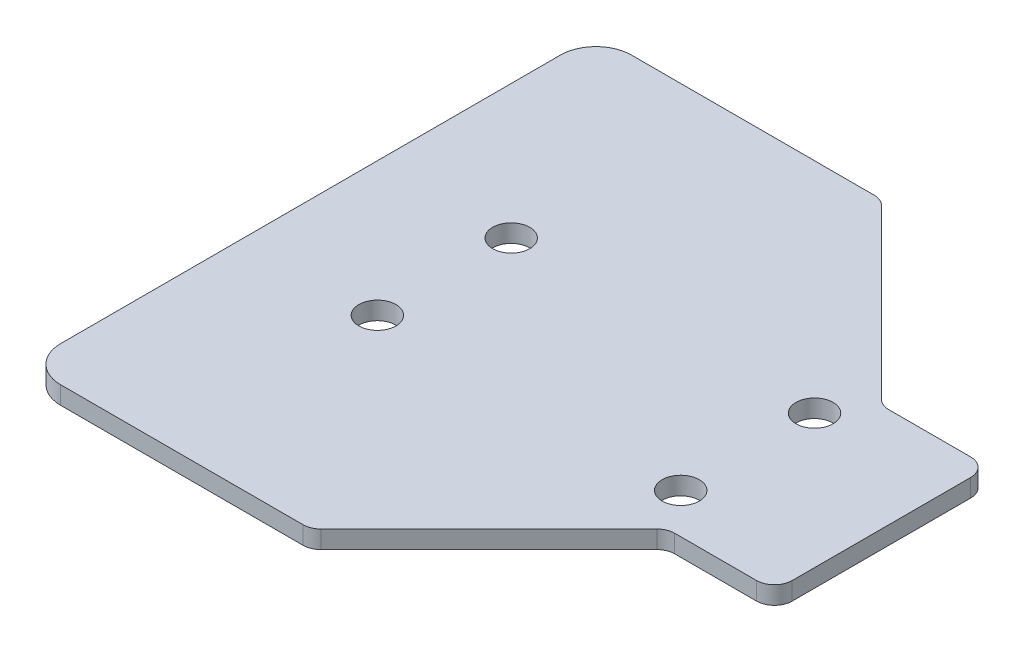
ISO-10303-21;
HEADER;
FILE_DESCRIPTION(('STEP AP214'),'2;1');
FILE_NAME('part.step','',(''),(''),'','','');
FILE_SCHEMA(('AUTOMOTIVE_DESIGN { 1 0 10303 214 1 1 1 1 }'));
ENDSEC;
DATA;
#1=APPLICATION_CONTEXT('core data for automotive mechanical design processes');
#2=APPLICATION_PROTOCOL_DEFINITION('international standard','automotive_design',2000,#1);
#3=PRODUCT_CONTEXT('',#1,'mechanical');
#4=PRODUCT('Part','Part','',(#3));
#5=PRODUCT_RELATED_PRODUCT_CATEGORY('part','',(#4));
#6=PRODUCT_DEFINITION_FORMATION('','',#4);
#7=PRODUCT_DEFINITION_CONTEXT('part definition',#1,'design');
#8=PRODUCT_DEFINITION('design','',#6,#7);
#9=PRODUCT_DEFINITION_SHAPE('','',#8);
#10=(LENGTH_UNIT() NAMED_UNIT(*) SI_UNIT(.MILLI.,.METRE.));
#11=(NAMED_UNIT(*) PLANE_ANGLE_UNIT() SI_UNIT($,.RADIAN.));
#12=(NAMED_UNIT(*) SI_UNIT($,.STERADIAN.) SOLID_ANGLE_UNIT());
#13=UNCERTAINTY_MEASURE_WITH_UNIT(LENGTH_MEASURE(1.E-05),#10,'distance_accuracy_value','');
#14=(GEOMETRIC_REPRESENTATION_CONTEXT(3) GLOBAL_UNCERTAINTY_ASSIGNED_CONTEXT((#13)) GLOBAL_UNIT_ASSIGNED_CONTEXT((#10,
#11,#12)) REPRESENTATION_CONTEXT('',''));
#15=CARTESIAN_POINT('',(0.,0.,0.));
#16=DIRECTION('',(0.,0.,1.));
#17=DIRECTION('',(1.,0.,0.));
#18=AXIS2_PLACEMENT_3D('',#15,#16,#17);
#19=CARTESIAN_POINT('',(0.,0.,0.));
#20=DIRECTION('',(0.,1.,0.));
#21=DIRECTION('',(0.,0.,1.));
#22=AXIS2_PLACEMENT_3D('',#19,#20,#21);
#23=PLANE('',#22);
#24=CARTESIAN_POINT('',(-26.9875,0.,-11.90625));
#25=DIRECTION('',(0.,-1.,0.));
#26=DIRECTION('',(0.,0.,-1.));
#27=AXIS2_PLACEMENT_3D('',#24,#25,#26);
#28=CIRCLE('',#27,3.302);
#29=CARTESIAN_POINT('',(-26.9875,0.,-15.20825));
#30=VERTEX_POINT('',#29);
#31=EDGE_CURVE('E220',#30,#30,#28,.F.);
#32=ORIENTED_EDGE('',*,*,#31,.T.);
#33=EDGE_LOOP('',(#32));
#34=FACE_BOUND('',#33,.T.);
#35=CARTESIAN_POINT('',(26.9875,0.,11.90625));
#36=DIRECTION('',(0.,-1.,0.));
#37=DIRECTION('',(0.,0.,-1.));
#38=AXIS2_PLACEMENT_3D('',#35,#36,#37);
#39=CIRCLE('',#38,3.302);
#40=CARTESIAN_POINT('',(26.9875,0.,8.60425));
#41=VERTEX_POINT('',#40);
#42=EDGE_CURVE('E223',#41,#41,#39,.F.);
#43=ORIENTED_EDGE('',*,*,#42,.T.);
#44=EDGE_LOOP('',(#43));
#45=FACE_BOUND('',#44,.T.);
#46=CARTESIAN_POINT('',(26.9875,0.,-11.90625));
#47=DIRECTION('',(0.,1.,0.));
#48=DIRECTION('',(0.,0.,1.));
#49=AXIS2_PLACEMENT_3D('',#46,#47,#48);
#50=CIRCLE('',#49,3.302);
#51=CARTESIAN_POINT('',(26.9875,0.,-8.60425));
#52=VERTEX_POINT('',#51);
#53=EDGE_CURVE('E226',#52,#52,#50,.T.);
#54=ORIENTED_EDGE('',*,*,#53,.T.);
#55=EDGE_LOOP('',(#54));
#56=FACE_BOUND('',#55,.T.);
#57=CARTESIAN_POINT('',(-26.9875,0.,11.90625));
#58=DIRECTION('',(0.,1.,0.));
#59=DIRECTION('',(0.,0.,1.));
#60=AXIS2_PLACEMENT_3D('',#57,#58,#59);
#61=CIRCLE('',#60,3.302);
#62=CARTESIAN_POINT('',(-26.9875,0.,15.20825));
#63=VERTEX_POINT('',#62);
#64=EDGE_CURVE('E229',#63,#63,#61,.T.);
#65=ORIENTED_EDGE('',*,*,#64,.T.);
#66=EDGE_LOOP('',(#65));
#67=FACE_BOUND('',#66,.T.);
#68=CARTESIAN_POINT('',(33.0651280605438,0.,22.225));
#69=DIRECTION('',(0.,1.,0.));
#70=DIRECTION('',(0.,0.,1.));
#71=AXIS2_PLACEMENT_3D('',#68,#69,#70);
#72=CIRCLE('',#71,3.175);
#73=CARTESIAN_POINT('',(33.0651280605438,0.,19.05));
#74=VERTEX_POINT('',#73);
#75=CARTESIAN_POINT('',(30.8200640302698,0.,19.9799359697349));
#76=VERTEX_POINT('',#75);
#77=EDGE_CURVE('E164',#74,#76,#72,.T.);
#78=ORIENTED_EDGE('',*,*,#77,.T.);
#79=DIRECTION('',(-0.707106781186548,0.,0.707106781186548));
#80=VECTOR('',#79,1.);
#81=CARTESIAN_POINT('',(0.,0.,50.8));
#82=LINE('',#81,#80);
#83=CARTESIAN_POINT('',(0.929935969734704,0.,49.8700640302653));
#84=VERTEX_POINT('',#83);
#85=EDGE_CURVE('E161',#76,#84,#82,.T.);
#86=ORIENTED_EDGE('',*,*,#85,.T.);
#87=CARTESIAN_POINT('',(-1.31512806053466,0.,47.625));
#88=DIRECTION('',(0.,1.,0.));
#89=DIRECTION('',(0.,0.,1.));
#90=AXIS2_PLACEMENT_3D('',#87,#88,#89);
#91=CIRCLE('',#90,3.175);
#92=CARTESIAN_POINT('',(-1.31512806053466,0.,50.8));
#93=VERTEX_POINT('',#92);
#94=EDGE_CURVE('E236',#93,#84,#91,.T.);
#95=ORIENTED_EDGE('',*,*,#94,.F.);
#96=DIRECTION('',(1.,0.,0.));
#97=VECTOR('',#96,1.);
#98=CARTESIAN_POINT('',(-50.8,0.,50.8));
#99=LINE('',#98,#97);
#100=CARTESIAN_POINT('',(-44.45,0.,50.8));
#101=VERTEX_POINT('',#100);
#102=EDGE_CURVE('E166',#101,#93,#99,.T.);
#103=ORIENTED_EDGE('',*,*,#102,.F.);
#104=CARTESIAN_POINT('',(-44.45,0.,44.45));
#105=DIRECTION('',(0.,-1.,0.));
#106=DIRECTION('',(0.,0.,-1.));
#107=AXIS2_PLACEMENT_3D('',#104,#105,#106);
#108=CIRCLE('',#107,6.35);
#109=CARTESIAN_POINT('',(-50.8,0.,44.45));
#110=VERTEX_POINT('',#109);
#111=EDGE_CURVE('E238',#110,#101,#108,.F.);
#112=ORIENTED_EDGE('',*,*,#111,.F.);
#113=DIRECTION('',(0.,0.,1.));
#114=VECTOR('',#113,1.);
#115=CARTESIAN_POINT('',(-50.8,0.,-50.8));
#116=LINE('',#115,#114);
#117=CARTESIAN_POINT('',(-50.8,0.,-44.45));
#118=VERTEX_POINT('',#117);
#119=EDGE_CURVE('E170',#118,#110,#116,.T.);
#120=ORIENTED_EDGE('',*,*,#119,.F.);
#121=CARTESIAN_POINT('',(-44.45,0.,-44.45));
#122=DIRECTION('',(0.,-1.,0.));
#123=DIRECTION('',(0.,0.,-1.));
#124=AXIS2_PLACEMENT_3D('',#121,#122,#123);
#125=CIRCLE('',#124,6.35);
#126=CARTESIAN_POINT('',(-44.45,0.,-50.8));
#127=VERTEX_POINT('',#126);
#128=EDGE_CURVE('E173',#127,#118,#125,.F.);
#129=ORIENTED_EDGE('',*,*,#128,.F.);
#130=DIRECTION('',(-1.,0.,0.));
#131=VECTOR('',#130,1.);
#132=CARTESIAN_POINT('',(50.8,0.,-50.8));
#133=LINE('',#132,#131);
#134=CARTESIAN_POINT('',(-1.31512806053466,0.,-50.8));
#135=VERTEX_POINT('',#134);
#136=EDGE_CURVE('E174',#135,#127,#133,.T.);
#137=ORIENTED_EDGE('',*,*,#136,.F.);
#138=CARTESIAN_POINT('',(-1.31512806053466,0.,-47.625));
#139=DIRECTION('',(0.,-1.,0.));
#140=DIRECTION('',(0.,0.,-1.));
#141=AXIS2_PLACEMENT_3D('',#138,#139,#140);
#142=CIRCLE('',#141,3.175);
#143=CARTESIAN_POINT('',(0.929935969734685,0.,-49.8700640302653));
#144=VERTEX_POINT('',#143);
#145=EDGE_CURVE('E177',#144,#135,#142,.F.);
#146=ORIENTED_EDGE('',*,*,#145,.F.);
#147=DIRECTION('',(-0.707106781186548,0.,-0.707106781186548));
#148=VECTOR('',#147,1.);
#149=CARTESIAN_POINT('',(0.,0.,-50.8));
#150=LINE('',#149,#148);
#151=CARTESIAN_POINT('',(30.8200640302675,0.,-19.9799359697325));
#152=VERTEX_POINT('',#151);
#153=EDGE_CURVE('E178',#152,#144,#150,.T.);
#154=ORIENTED_EDGE('',*,*,#153,.F.);
#155=CARTESIAN_POINT('',(33.0651280605438,0.,-22.225));
#156=DIRECTION('',(0.,-1.,0.));
#157=DIRECTION('',(0.,0.,-1.));
#158=AXIS2_PLACEMENT_3D('',#155,#156,#157);
#159=CIRCLE('',#158,3.175);
#160=CARTESIAN_POINT('',(33.0651280605438,0.,-19.05));
#161=VERTEX_POINT('',#160);
#162=EDGE_CURVE('E135',#152,#161,#159,.F.);
#163=ORIENTED_EDGE('',*,*,#162,.T.);
#164=DIRECTION('',(-1.,0.,0.));
#165=VECTOR('',#164,1.);
#166=CARTESIAN_POINT('',(31.75,0.,-19.05));
#167=LINE('',#166,#165);
#168=CARTESIAN_POINT('',(47.625,0.,-19.05));
#169=VERTEX_POINT('',#168);
#170=EDGE_CURVE('E131',#169,#161,#167,.T.);
#171=ORIENTED_EDGE('',*,*,#170,.F.);
#172=CARTESIAN_POINT('',(47.625,0.,-15.875));
#173=DIRECTION('',(0.,1.,0.));
#174=DIRECTION('',(0.,0.,1.));
#175=AXIS2_PLACEMENT_3D('',#172,#173,#174);
#176=CIRCLE('',#175,3.175);
#177=CARTESIAN_POINT('',(50.8,0.,-15.875));
#178=VERTEX_POINT('',#177);
#179=EDGE_CURVE('E20',#178,#169,#176,.T.);
#180=ORIENTED_EDGE('',*,*,#179,.F.);
#181=DIRECTION('',(0.,0.,-1.));
#182=VECTOR('',#181,1.);
#183=CARTESIAN_POINT('',(50.8,0.,50.8));
#184=LINE('',#183,#182);
#185=CARTESIAN_POINT('',(50.8,0.,15.875));
#186=VERTEX_POINT('',#185);
#187=EDGE_CURVE('E126',#186,#178,#184,.T.);
#188=ORIENTED_EDGE('',*,*,#187,.F.);
#189=CARTESIAN_POINT('',(47.625,0.,15.875));
#190=DIRECTION('',(0.,-1.,0.));
#191=DIRECTION('',(0.,0.,-1.));
#192=AXIS2_PLACEMENT_3D('',#189,#190,#191);
#193=CIRCLE('',#192,3.175);
#194=CARTESIAN_POINT('',(47.625,0.,19.05));
#195=VERTEX_POINT('',#194);
#196=EDGE_CURVE('E232',#195,#186,#193,.F.);
#197=ORIENTED_EDGE('',*,*,#196,.F.);
#198=DIRECTION('',(-1.,0.,0.));
#199=VECTOR('',#198,1.);
#200=CARTESIAN_POINT('',(31.75,0.,19.05));
#201=LINE('',#200,#199);
#202=EDGE_CURVE('E156',#195,#74,#201,.T.);
#203=ORIENTED_EDGE('',*,*,#202,.T.);
#204=EDGE_LOOP('',(#78,#86,#95,#103,#112,#120,#129,#137,#146,#154,#163,#171,#180,#188,#197,#203));
#205=FACE_BOUND('',#204,.T.);
#206=ADVANCED_FACE('F17',(#34,#45,#56,#67,#205),#23,.F.);
#207=CARTESIAN_POINT('',(50.8,0.,50.8));
#208=DIRECTION('',(1.,0.,0.));
#209=DIRECTION('',(0.,0.,-1.));
#210=AXIS2_PLACEMENT_3D('',#207,#208,#209);
#211=PLANE('',#210);
#212=DIRECTION('',(0.,0.,1.));
#213=VECTOR('',#212,1.);
#214=CARTESIAN_POINT('',(50.8,3.175,0.));
#215=LINE('',#214,#213);
#216=CARTESIAN_POINT('',(50.8,3.175,15.875));
#217=VERTEX_POINT('',#216);
#218=CARTESIAN_POINT('',(50.8,3.175,-15.875));
#219=VERTEX_POINT('',#218);
#220=EDGE_CURVE('E219',#217,#219,#215,.F.);
#221=ORIENTED_EDGE('',*,*,#220,.F.);
#222=DIRECTION('',(0.,-1.,0.));
#223=VECTOR('',#222,1.);
#224=CARTESIAN_POINT('',(50.8,7.31393,15.875));
#225=LINE('',#224,#223);
#226=EDGE_CURVE('E266',#186,#217,#225,.F.);
#227=ORIENTED_EDGE('',*,*,#226,.F.);
#228=ORIENTED_EDGE('',*,*,#187,.T.);
#229=DIRECTION('',(0.,1.,0.));
#230=VECTOR('',#229,1.);
#231=CARTESIAN_POINT('',(50.8,-4.13893,-15.875));
#232=LINE('',#231,#230);
#233=EDGE_CURVE('E145',#219,#178,#232,.F.);
#234=ORIENTED_EDGE('',*,*,#233,.F.);
#235=EDGE_LOOP('',(#221,#227,#228,#234));
#236=FACE_BOUND('',#235,.T.);
#237=ADVANCED_FACE('F506',(#236),#211,.T.);
#238=CARTESIAN_POINT('',(47.625,-4.13893,-15.875));
#239=DIRECTION('',(0.,1.,0.));
#240=DIRECTION('',(0.,0.,1.));
#241=AXIS2_PLACEMENT_3D('',#238,#239,#240);
#242=CYLINDRICAL_SURFACE('',#241,3.175);
#243=DIRECTION('',(0.,1.,0.));
#244=VECTOR('',#243,1.);
#245=CARTESIAN_POINT('',(47.625,0.,-19.05));
#246=LINE('',#245,#244);
#247=CARTESIAN_POINT('',(47.625,3.175,-19.05));
#248=VERTEX_POINT('',#247);
#249=EDGE_CURVE('E139',#248,#169,#246,.F.);
#250=ORIENTED_EDGE('',*,*,#249,.F.);
#251=CARTESIAN_POINT('',(47.625,3.175,-15.875));
#252=DIRECTION('',(0.,1.,0.));
#253=DIRECTION('',(0.,0.,1.));
#254=AXIS2_PLACEMENT_3D('',#251,#252,#253);
#255=CIRCLE('',#254,3.175);
#256=EDGE_CURVE('E217',#219,#248,#255,.T.);
#257=ORIENTED_EDGE('',*,*,#256,.F.);
#258=ORIENTED_EDGE('',*,*,#233,.T.);
#259=ORIENTED_EDGE('',*,*,#179,.T.);
#260=EDGE_LOOP('',(#250,#257,#258,#259));
#261=FACE_BOUND('',#260,.T.);
#262=ADVANCED_FACE('F142',(#261),#242,.T.);
#263=CARTESIAN_POINT('',(31.75,0.,-19.05));
#264=DIRECTION('',(0.,0.,-1.));
#265=DIRECTION('',(-1.,0.,0.));
#266=AXIS2_PLACEMENT_3D('',#263,#264,#265);
#267=PLANE('',#266);
#268=DIRECTION('',(1.,0.,0.));
#269=VECTOR('',#268,1.);
#270=CARTESIAN_POINT('',(0.,3.175,-19.05));
#271=LINE('',#270,#269);
#272=CARTESIAN_POINT('',(33.0651280605438,3.175,-19.05));
#273=VERTEX_POINT('',#272);
#274=EDGE_CURVE('E148',#248,#273,#271,.F.);
#275=ORIENTED_EDGE('',*,*,#274,.F.);
#276=ORIENTED_EDGE('',*,*,#249,.T.);
#277=ORIENTED_EDGE('',*,*,#170,.T.);
#278=DIRECTION('',(0.,-1.,0.));
#279=VECTOR('',#278,1.);
#280=CARTESIAN_POINT('',(33.0651280605438,7.31393,-19.05));
#281=LINE('',#280,#279);
#282=EDGE_CURVE('E150',#161,#273,#281,.F.);
#283=ORIENTED_EDGE('',*,*,#282,.T.);
#284=EDGE_LOOP('',(#275,#276,#277,#283));
#285=FACE_BOUND('',#284,.T.);
#286=ADVANCED_FACE('F146',(#285),#267,.T.);
#287=CARTESIAN_POINT('',(33.0651280605438,7.31393,-22.225));
#288=DIRECTION('',(0.,-1.,0.));
#289=DIRECTION('',(0.,0.,-1.));
#290=AXIS2_PLACEMENT_3D('',#287,#288,#289);
#291=CYLINDRICAL_SURFACE('',#290,3.175);
#292=DIRECTION('',(0.,1.,0.));
#293=VECTOR('',#292,1.);
#294=CARTESIAN_POINT('',(30.820064030263,0.,-19.979935969737));
#295=LINE('',#294,#293);
#296=CARTESIAN_POINT('',(30.8200640302656,3.175,-19.9799359697306));
#297=VERTEX_POINT('',#296);
#298=EDGE_CURVE('E180',#297,#152,#295,.F.);
#299=ORIENTED_EDGE('',*,*,#298,.F.);
#300=CARTESIAN_POINT('',(33.0651280605438,3.175,-22.225));
#301=DIRECTION('',(0.,-1.,0.));
#302=DIRECTION('',(0.,0.,-1.));
#303=AXIS2_PLACEMENT_3D('',#300,#301,#302);
#304=CIRCLE('',#303,3.175);
#305=EDGE_CURVE('E214',#273,#297,#304,.T.);
#306=ORIENTED_EDGE('',*,*,#305,.F.);
#307=ORIENTED_EDGE('',*,*,#282,.F.);
#308=ORIENTED_EDGE('',*,*,#162,.F.);
#309=EDGE_LOOP('',(#299,#306,#307,#308));
#310=FACE_BOUND('',#309,.T.);
#311=ADVANCED_FACE('F328',(#310),#291,.F.);
#312=CARTESIAN_POINT('',(0.,0.,-50.8));
#313=DIRECTION('',(0.707106781186548,0.,-0.707106781186548));
#314=DIRECTION('',(-0.707106781186548,0.,-0.707106781186548));
#315=AXIS2_PLACEMENT_3D('',#312,#313,#314);
#316=PLANE('',#315);
#317=ORIENTED_EDGE('',*,*,#153,.T.);
#318=DIRECTION('',(0.,-1.,0.));
#319=VECTOR('',#318,1.);
#320=CARTESIAN_POINT('',(0.929935969736699,7.31393,-49.8700640302632));
#321=LINE('',#320,#319);
#322=CARTESIAN_POINT('',(0.929935969732642,3.175,-49.8700640302633));
#323=VERTEX_POINT('',#322);
#324=EDGE_CURVE('E179',#323,#144,#321,.T.);
#325=ORIENTED_EDGE('',*,*,#324,.F.);
#326=DIRECTION('',(-0.707106781186554,0.,-0.707106781186541));
#327=VECTOR('',#326,1.);
#328=CARTESIAN_POINT('',(30.8200640302592,3.175,-19.9799359697332));
#329=LINE('',#328,#327);
#330=EDGE_CURVE('E213',#297,#323,#329,.T.);
#331=ORIENTED_EDGE('',*,*,#330,.F.);
#332=ORIENTED_EDGE('',*,*,#298,.T.);
#333=EDGE_LOOP('',(#317,#325,#331,#332));
#334=FACE_BOUND('',#333,.T.);
#335=ADVANCED_FACE('F325',(#334),#316,.T.);
#336=CARTESIAN_POINT('',(-1.31512806053466,7.31393,-47.625));
#337=DIRECTION('',(0.,-1.,0.));
#338=DIRECTION('',(0.,0.,-1.));
#339=AXIS2_PLACEMENT_3D('',#336,#337,#338);
#340=CYLINDRICAL_SURFACE('',#339,3.175);
#341=ORIENTED_EDGE('',*,*,#324,.T.);
#342=ORIENTED_EDGE('',*,*,#145,.T.);
#343=DIRECTION('',(0.,1.,0.));
#344=VECTOR('',#343,1.);
#345=CARTESIAN_POINT('',(-1.31512806053466,0.,-50.8));
#346=LINE('',#345,#344);
#347=CARTESIAN_POINT('',(-1.31512806053466,3.175,-50.8));
#348=VERTEX_POINT('',#347);
#349=EDGE_CURVE('E176',#348,#135,#346,.F.);
#350=ORIENTED_EDGE('',*,*,#349,.F.);
#351=CARTESIAN_POINT('',(-1.31512806053466,3.175,-47.625));
#352=DIRECTION('',(0.,-1.,0.));
#353=DIRECTION('',(0.,0.,-1.));
#354=AXIS2_PLACEMENT_3D('',#351,#352,#353);
#355=CIRCLE('',#354,3.175);
#356=EDGE_CURVE('E210',#323,#348,#355,.F.);
#357=ORIENTED_EDGE('',*,*,#356,.F.);
#358=EDGE_LOOP('',(#341,#342,#350,#357));
#359=FACE_BOUND('',#358,.T.);
#360=ADVANCED_FACE('F323',(#359),#340,.T.);
#361=CARTESIAN_POINT('',(50.8,0.,-50.8));
#362=DIRECTION('',(0.,0.,-1.));
#363=DIRECTION('',(-1.,0.,0.));
#364=AXIS2_PLACEMENT_3D('',#361,#362,#363);
#365=PLANE('',#364);
#366=DIRECTION('',(1.,0.,0.));
#367=VECTOR('',#366,1.);
#368=CARTESIAN_POINT('',(0.,3.175,-50.8));
#369=LINE('',#368,#367);
#370=CARTESIAN_POINT('',(-44.45,3.175,-50.8));
#371=VERTEX_POINT('',#370);
#372=EDGE_CURVE('E209',#348,#371,#369,.F.);
#373=ORIENTED_EDGE('',*,*,#372,.F.);
#374=ORIENTED_EDGE('',*,*,#349,.T.);
#375=ORIENTED_EDGE('',*,*,#136,.T.);
#376=DIRECTION('',(0.,-1.,0.));
#377=VECTOR('',#376,1.);
#378=CARTESIAN_POINT('',(-44.45,11.13155,-50.8));
#379=LINE('',#378,#377);
#380=EDGE_CURVE('E243',#371,#127,#379,.T.);
#381=ORIENTED_EDGE('',*,*,#380,.F.);
#382=EDGE_LOOP('',(#373,#374,#375,#381));
#383=FACE_BOUND('',#382,.T.);
#384=ADVANCED_FACE('F320',(#383),#365,.T.);
#385=CARTESIAN_POINT('',(-44.45,11.13155,-44.45));
#386=DIRECTION('',(0.,-1.,0.));
#387=DIRECTION('',(0.,0.,-1.));
#388=AXIS2_PLACEMENT_3D('',#385,#386,#387);
#389=CYLINDRICAL_SURFACE('',#388,6.35);
#390=ORIENTED_EDGE('',*,*,#380,.T.);
#391=ORIENTED_EDGE('',*,*,#128,.T.);
#392=DIRECTION('',(0.,1.,0.));
#393=VECTOR('',#392,1.);
#394=CARTESIAN_POINT('',(-50.8,0.,-44.45));
#395=LINE('',#394,#393);
#396=CARTESIAN_POINT('',(-50.8,3.175,-44.45));
#397=VERTEX_POINT('',#396);
#398=EDGE_CURVE('E172',#397,#118,#395,.F.);
#399=ORIENTED_EDGE('',*,*,#398,.F.);
#400=CARTESIAN_POINT('',(-44.45,3.175,-44.45));
#401=DIRECTION('',(0.,-1.,0.));
#402=DIRECTION('',(0.,0.,-1.));
#403=AXIS2_PLACEMENT_3D('',#400,#401,#402);
#404=CIRCLE('',#403,6.35);
#405=EDGE_CURVE('E206',#371,#397,#404,.F.);
#406=ORIENTED_EDGE('',*,*,#405,.F.);
#407=EDGE_LOOP('',(#390,#391,#399,#406));
#408=FACE_BOUND('',#407,.T.);
#409=ADVANCED_FACE('F316',(#408),#389,.T.);
#410=CARTESIAN_POINT('',(-50.8,0.,-50.8));
#411=DIRECTION('',(-1.,0.,0.));
#412=DIRECTION('',(0.,0.,1.));
#413=AXIS2_PLACEMENT_3D('',#410,#411,#412);
#414=PLANE('',#413);
#415=DIRECTION('',(0.,0.,1.));
#416=VECTOR('',#415,1.);
#417=CARTESIAN_POINT('',(-50.8,3.175,0.));
#418=LINE('',#417,#416);
#419=CARTESIAN_POINT('',(-50.8,3.175,44.45));
#420=VERTEX_POINT('',#419);
#421=EDGE_CURVE('E205',#397,#420,#418,.T.);
#422=ORIENTED_EDGE('',*,*,#421,.F.);
#423=ORIENTED_EDGE('',*,*,#398,.T.);
#424=ORIENTED_EDGE('',*,*,#119,.T.);
#425=DIRECTION('',(0.,-1.,0.));
#426=VECTOR('',#425,1.);
#427=CARTESIAN_POINT('',(-50.8,11.13155,44.45));
#428=LINE('',#427,#426);
#429=EDGE_CURVE('E240',#420,#110,#428,.T.);
#430=ORIENTED_EDGE('',*,*,#429,.F.);
#431=EDGE_LOOP('',(#422,#423,#424,#430));
#432=FACE_BOUND('',#431,.T.);
#433=ADVANCED_FACE('F313',(#432),#414,.T.);
#434=CARTESIAN_POINT('',(-44.45,11.13155,44.45));
#435=DIRECTION('',(0.,-1.,0.));
#436=DIRECTION('',(0.,0.,-1.));
#437=AXIS2_PLACEMENT_3D('',#434,#435,#436);
#438=CYLINDRICAL_SURFACE('',#437,6.35);
#439=ORIENTED_EDGE('',*,*,#429,.T.);
#440=ORIENTED_EDGE('',*,*,#111,.T.);
#441=DIRECTION('',(0.,1.,0.));
#442=VECTOR('',#441,1.);
#443=CARTESIAN_POINT('',(-44.45,0.,50.8));
#444=LINE('',#443,#442);
#445=CARTESIAN_POINT('',(-44.45,3.175,50.8));
#446=VERTEX_POINT('',#445);
#447=EDGE_CURVE('E169',#446,#101,#444,.F.);
#448=ORIENTED_EDGE('',*,*,#447,.F.);
#449=CARTESIAN_POINT('',(-44.45,3.175,44.45));
#450=DIRECTION('',(0.,-1.,0.));
#451=DIRECTION('',(0.,0.,-1.));
#452=AXIS2_PLACEMENT_3D('',#449,#450,#451);
#453=CIRCLE('',#452,6.35);
#454=EDGE_CURVE('E202',#420,#446,#453,.F.);
#455=ORIENTED_EDGE('',*,*,#454,.F.);
#456=EDGE_LOOP('',(#439,#440,#448,#455));
#457=FACE_BOUND('',#456,.T.);
#458=ADVANCED_FACE('F310',(#457),#438,.T.);
#459=CARTESIAN_POINT('',(-50.8,0.,50.8));
#460=DIRECTION('',(0.,0.,1.));
#461=DIRECTION('',(1.,0.,0.));
#462=AXIS2_PLACEMENT_3D('',#459,#460,#461);
#463=PLANE('',#462);
#464=ORIENTED_EDGE('',*,*,#102,.T.);
#465=DIRECTION('',(0.,1.,0.));
#466=VECTOR('',#465,1.);
#467=CARTESIAN_POINT('',(-1.31512806053466,-4.13893,50.8));
#468=LINE('',#467,#466);
#469=CARTESIAN_POINT('',(-1.31512806053466,3.175,50.8));
#470=VERTEX_POINT('',#469);
#471=EDGE_CURVE('E168',#470,#93,#468,.F.);
#472=ORIENTED_EDGE('',*,*,#471,.F.);
#473=DIRECTION('',(1.,0.,0.));
#474=VECTOR('',#473,1.);
#475=CARTESIAN_POINT('',(0.,3.175,50.8));
#476=LINE('',#475,#474);
#477=EDGE_CURVE('E201',#446,#470,#476,.T.);
#478=ORIENTED_EDGE('',*,*,#477,.F.);
#479=ORIENTED_EDGE('',*,*,#447,.T.);
#480=EDGE_LOOP('',(#464,#472,#478,#479));
#481=FACE_BOUND('',#480,.T.);
#482=ADVANCED_FACE('F307',(#481),#463,.T.);
#483=CARTESIAN_POINT('',(-1.31512806053466,-4.13893,47.625));
#484=DIRECTION('',(0.,1.,0.));
#485=DIRECTION('',(0.,0.,1.));
#486=AXIS2_PLACEMENT_3D('',#483,#484,#485);
#487=CYLINDRICAL_SURFACE('',#486,3.175);
#488=DIRECTION('',(0.,1.,0.));
#489=VECTOR('',#488,1.);
#490=CARTESIAN_POINT('',(0.929935969736736,0.,49.8700640302633));
#491=LINE('',#490,#489);
#492=CARTESIAN_POINT('',(0.929935969732661,3.175,49.8700640302633));
#493=VERTEX_POINT('',#492);
#494=EDGE_CURVE('E165',#84,#493,#491,.T.);
#495=ORIENTED_EDGE('',*,*,#494,.T.);
#496=CARTESIAN_POINT('',(-1.31512806053466,3.175,47.625));
#497=DIRECTION('',(0.,1.,0.));
#498=DIRECTION('',(0.,0.,1.));
#499=AXIS2_PLACEMENT_3D('',#496,#497,#498);
#500=CIRCLE('',#499,3.175);
#501=EDGE_CURVE('E198',#470,#493,#500,.T.);
#502=ORIENTED_EDGE('',*,*,#501,.F.);
#503=ORIENTED_EDGE('',*,*,#471,.T.);
#504=ORIENTED_EDGE('',*,*,#94,.T.);
#505=EDGE_LOOP('',(#495,#502,#503,#504));
#506=FACE_BOUND('',#505,.T.);
#507=ADVANCED_FACE('F302',(#506),#487,.T.);
#508=CARTESIAN_POINT('',(0.,0.,50.8));
#509=DIRECTION('',(-0.707106781186548,0.,-0.707106781186548));
#510=DIRECTION('',(-0.707106781186548,0.,0.707106781186548));
#511=AXIS2_PLACEMENT_3D('',#508,#509,#510);
#512=PLANE('',#511);
#513=DIRECTION('',(0.,1.,0.));
#514=VECTOR('',#513,1.);
#515=CARTESIAN_POINT('',(30.8200640302676,-4.13893,19.9799359697416));
#516=LINE('',#515,#514);
#517=CARTESIAN_POINT('',(30.8200640302679,3.175,19.9799359697329));
#518=VERTEX_POINT('',#517);
#519=EDGE_CURVE('E159',#76,#518,#516,.T.);
#520=ORIENTED_EDGE('',*,*,#519,.T.);
#521=DIRECTION('',(0.707106781186554,0.,-0.707106781186541));
#522=VECTOR('',#521,1.);
#523=CARTESIAN_POINT('',(0.929935969732672,3.175,49.8700640302592));
#524=LINE('',#523,#522);
#525=EDGE_CURVE('E197',#493,#518,#524,.T.);
#526=ORIENTED_EDGE('',*,*,#525,.F.);
#527=ORIENTED_EDGE('',*,*,#494,.F.);
#528=ORIENTED_EDGE('',*,*,#85,.F.);
#529=EDGE_LOOP('',(#520,#526,#527,#528));
#530=FACE_BOUND('',#529,.T.);
#531=ADVANCED_FACE('F298',(#530),#512,.F.);
#532=CARTESIAN_POINT('',(33.0651280605438,-4.13893,22.225));
#533=DIRECTION('',(0.,1.,0.));
#534=DIRECTION('',(0.,0.,1.));
#535=AXIS2_PLACEMENT_3D('',#532,#533,#534);
#536=CYLINDRICAL_SURFACE('',#535,3.175);
#537=ORIENTED_EDGE('',*,*,#519,.F.);
#538=ORIENTED_EDGE('',*,*,#77,.F.);
#539=DIRECTION('',(0.,1.,0.));
#540=VECTOR('',#539,1.);
#541=CARTESIAN_POINT('',(33.0651280605438,0.,19.05));
#542=LINE('',#541,#540);
#543=CARTESIAN_POINT('',(33.0651280605438,3.175,19.05));
#544=VERTEX_POINT('',#543);
#545=EDGE_CURVE('E158',#74,#544,#542,.T.);
#546=ORIENTED_EDGE('',*,*,#545,.T.);
#547=CARTESIAN_POINT('',(33.0651280605438,3.175,22.225));
#548=DIRECTION('',(0.,1.,0.));
#549=DIRECTION('',(0.,0.,1.));
#550=AXIS2_PLACEMENT_3D('',#547,#548,#549);
#551=CIRCLE('',#550,3.175);
#552=EDGE_CURVE('E194',#518,#544,#551,.F.);
#553=ORIENTED_EDGE('',*,*,#552,.F.);
#554=EDGE_LOOP('',(#537,#538,#546,#553));
#555=FACE_BOUND('',#554,.T.);
#556=ADVANCED_FACE('F293',(#555),#536,.F.);
#557=CARTESIAN_POINT('',(31.75,0.,19.05));
#558=DIRECTION('',(0.,0.,-1.));
#559=DIRECTION('',(-1.,0.,0.));
#560=AXIS2_PLACEMENT_3D('',#557,#558,#559);
#561=PLANE('',#560);
#562=ORIENTED_EDGE('',*,*,#545,.F.);
#563=ORIENTED_EDGE('',*,*,#202,.F.);
#564=DIRECTION('',(0.,-1.,0.));
#565=VECTOR('',#564,1.);
#566=CARTESIAN_POINT('',(47.625,7.31393,19.05));
#567=LINE('',#566,#565);
#568=CARTESIAN_POINT('',(47.625,3.175,19.05));
#569=VERTEX_POINT('',#568);
#570=EDGE_CURVE('E35',#569,#195,#567,.T.);
#571=ORIENTED_EDGE('',*,*,#570,.F.);
#572=DIRECTION('',(1.,0.,0.));
#573=VECTOR('',#572,1.);
#574=CARTESIAN_POINT('',(0.,3.175,19.05));
#575=LINE('',#574,#573);
#576=EDGE_CURVE('E193',#544,#569,#575,.T.);
#577=ORIENTED_EDGE('',*,*,#576,.F.);
#578=EDGE_LOOP('',(#562,#563,#571,#577));
#579=FACE_BOUND('',#578,.T.);
#580=ADVANCED_FACE('F288',(#579),#561,.F.);
#581=CARTESIAN_POINT('',(47.625,7.31393,15.875));
#582=DIRECTION('',(0.,-1.,0.));
#583=DIRECTION('',(0.,0.,-1.));
#584=AXIS2_PLACEMENT_3D('',#581,#582,#583);
#585=CYLINDRICAL_SURFACE('',#584,3.175);
#586=ORIENTED_EDGE('',*,*,#570,.T.);
#587=ORIENTED_EDGE('',*,*,#196,.T.);
#588=ORIENTED_EDGE('',*,*,#226,.T.);
#589=CARTESIAN_POINT('',(47.625,3.175,15.875));
#590=DIRECTION('',(0.,-1.,0.));
#591=DIRECTION('',(0.,0.,-1.));
#592=AXIS2_PLACEMENT_3D('',#589,#590,#591);
#593=CIRCLE('',#592,3.175);
#594=EDGE_CURVE('E190',#569,#217,#593,.F.);
#595=ORIENTED_EDGE('',*,*,#594,.F.);
#596=EDGE_LOOP('',(#586,#587,#588,#595));
#597=FACE_BOUND('',#596,.T.);
#598=ADVANCED_FACE('F360',(#597),#585,.T.);
#599=CARTESIAN_POINT('',(-26.9875,3.175,11.90625));
#600=DIRECTION('',(0.,1.,0.));
#601=DIRECTION('',(0.,0.,1.));
#602=AXIS2_PLACEMENT_3D('',#599,#600,#601);
#603=CYLINDRICAL_SURFACE('',#602,3.302);
#604=ORIENTED_EDGE('',*,*,#64,.F.);
#605=EDGE_LOOP('',(#604));
#606=FACE_BOUND('',#605,.T.);
#607=CARTESIAN_POINT('',(-26.9875,3.175,11.90625));
#608=DIRECTION('',(0.,1.,0.));
#609=DIRECTION('',(0.,0.,1.));
#610=AXIS2_PLACEMENT_3D('',#607,#608,#609);
#611=CIRCLE('',#610,3.302);
#612=CARTESIAN_POINT('',(-26.9875,3.175,15.20825));
#613=VERTEX_POINT('',#612);
#614=EDGE_CURVE('E187',#613,#613,#611,.F.);
#615=ORIENTED_EDGE('',*,*,#614,.F.);
#616=EDGE_LOOP('',(#615));
#617=FACE_BOUND('',#616,.T.);
#618=ADVANCED_FACE('F356',(#606,#617),#603,.F.);
#619=CARTESIAN_POINT('',(26.9875,3.175,-11.90625));
#620=DIRECTION('',(0.,1.,0.));
#621=DIRECTION('',(0.,0.,1.));
#622=AXIS2_PLACEMENT_3D('',#619,#620,#621);
#623=CYLINDRICAL_SURFACE('',#622,3.302);
#624=ORIENTED_EDGE('',*,*,#53,.F.);
#625=EDGE_LOOP('',(#624));
#626=FACE_BOUND('',#625,.T.);
#627=CARTESIAN_POINT('',(26.9875,3.175,-11.90625));
#628=DIRECTION('',(0.,1.,0.));
#629=DIRECTION('',(0.,0.,1.));
#630=AXIS2_PLACEMENT_3D('',#627,#628,#629);
#631=CIRCLE('',#630,3.302);
#632=CARTESIAN_POINT('',(26.9875,3.175,-8.60425));
#633=VERTEX_POINT('',#632);
#634=EDGE_CURVE('E184',#633,#633,#631,.F.);
#635=ORIENTED_EDGE('',*,*,#634,.F.);
#636=EDGE_LOOP('',(#635));
#637=FACE_BOUND('',#636,.T.);
#638=ADVANCED_FACE('F352',(#626,#637),#623,.F.);
#639=CARTESIAN_POINT('',(26.9875,3.175,11.90625));
#640=DIRECTION('',(0.,-1.,0.));
#641=DIRECTION('',(0.,0.,-1.));
#642=AXIS2_PLACEMENT_3D('',#639,#640,#641);
#643=CYLINDRICAL_SURFACE('',#642,3.302);
#644=CARTESIAN_POINT('',(26.9875,3.175,11.90625));
#645=DIRECTION('',(0.,-1.,0.));
#646=DIRECTION('',(0.,0.,-1.));
#647=AXIS2_PLACEMENT_3D('',#644,#645,#646);
#648=CIRCLE('',#647,3.302);
#649=CARTESIAN_POINT('',(26.9875,3.175,8.60425));
#650=VERTEX_POINT('',#649);
#651=EDGE_CURVE('E26',#650,#650,#648,.T.);
#652=ORIENTED_EDGE('',*,*,#651,.F.);
#653=EDGE_LOOP('',(#652));
#654=FACE_BOUND('',#653,.T.);
#655=ORIENTED_EDGE('',*,*,#42,.F.);
#656=EDGE_LOOP('',(#655));
#657=FACE_BOUND('',#656,.T.);
#658=ADVANCED_FACE('F345',(#654,#657),#643,.F.);
#659=CARTESIAN_POINT('',(-26.9875,3.175,-11.90625));
#660=DIRECTION('',(0.,-1.,0.));
#661=DIRECTION('',(0.,0.,-1.));
#662=AXIS2_PLACEMENT_3D('',#659,#660,#661);
#663=CYLINDRICAL_SURFACE('',#662,3.302);
#664=CARTESIAN_POINT('',(-26.9875,3.175,-11.90625));
#665=DIRECTION('',(0.,-1.,0.));
#666=DIRECTION('',(0.,0.,-1.));
#667=AXIS2_PLACEMENT_3D('',#664,#665,#666);
#668=CIRCLE('',#667,3.302);
#669=CARTESIAN_POINT('',(-26.9875,3.175,-15.20825));
#670=VERTEX_POINT('',#669);
#671=EDGE_CURVE('E11',#670,#670,#668,.T.);
#672=ORIENTED_EDGE('',*,*,#671,.F.);
#673=EDGE_LOOP('',(#672));
#674=FACE_BOUND('',#673,.T.);
#675=ORIENTED_EDGE('',*,*,#31,.F.);
#676=EDGE_LOOP('',(#675));
#677=FACE_BOUND('',#676,.T.);
#678=ADVANCED_FACE('F339',(#674,#677),#663,.F.);
#679=CARTESIAN_POINT('',(0.,3.175,0.));
#680=DIRECTION('',(0.,1.,0.));
#681=DIRECTION('',(0.,0.,1.));
#682=AXIS2_PLACEMENT_3D('',#679,#680,#681);
#683=PLANE('',#682);
#684=ORIENTED_EDGE('',*,*,#671,.T.);
#685=EDGE_LOOP('',(#684));
#686=FACE_BOUND('',#685,.T.);
#687=ORIENTED_EDGE('',*,*,#651,.T.);
#688=EDGE_LOOP('',(#687));
#689=FACE_BOUND('',#688,.T.);
#690=ORIENTED_EDGE('',*,*,#634,.T.);
#691=EDGE_LOOP('',(#690));
#692=FACE_BOUND('',#691,.T.);
#693=ORIENTED_EDGE('',*,*,#614,.T.);
#694=EDGE_LOOP('',(#693));
#695=FACE_BOUND('',#694,.T.);
#696=ORIENTED_EDGE('',*,*,#576,.T.);
#697=ORIENTED_EDGE('',*,*,#594,.T.);
#698=ORIENTED_EDGE('',*,*,#220,.T.);
#699=ORIENTED_EDGE('',*,*,#256,.T.);
#700=ORIENTED_EDGE('',*,*,#274,.T.);
#701=ORIENTED_EDGE('',*,*,#305,.T.);
#702=ORIENTED_EDGE('',*,*,#330,.T.);
#703=ORIENTED_EDGE('',*,*,#356,.T.);
#704=ORIENTED_EDGE('',*,*,#372,.T.);
#705=ORIENTED_EDGE('',*,*,#405,.T.);
#706=ORIENTED_EDGE('',*,*,#421,.T.);
#707=ORIENTED_EDGE('',*,*,#454,.T.);
#708=ORIENTED_EDGE('',*,*,#477,.T.);
#709=ORIENTED_EDGE('',*,*,#501,.T.);
#710=ORIENTED_EDGE('',*,*,#525,.T.);
#711=ORIENTED_EDGE('',*,*,#552,.T.);
#712=EDGE_LOOP('',(#696,#697,#698,#699,#700,#701,#702,#703,#704,#705,#706,#707,#708,#709,#710,#711));
#713=FACE_BOUND('',#712,.T.);
#714=ADVANCED_FACE('F285',(#686,#689,#692,#695,#713),#683,.T.);
#715=CLOSED_SHELL('',(#206,#237,#262,#286,#311,#335,#360,#384,#409,#433,#458,#482,#507,#531,
#556,#580,#598,#618,#638,#658,#678,#714));
#716=MANIFOLD_SOLID_BREP('B1',#715);
#717=ADVANCED_BREP_SHAPE_REPRESENTATION('',(#18,#716),#14);
#718=SHAPE_DEFINITION_REPRESENTATION(#9,#717);
ENDSEC;
END-ISO-10303-21;
